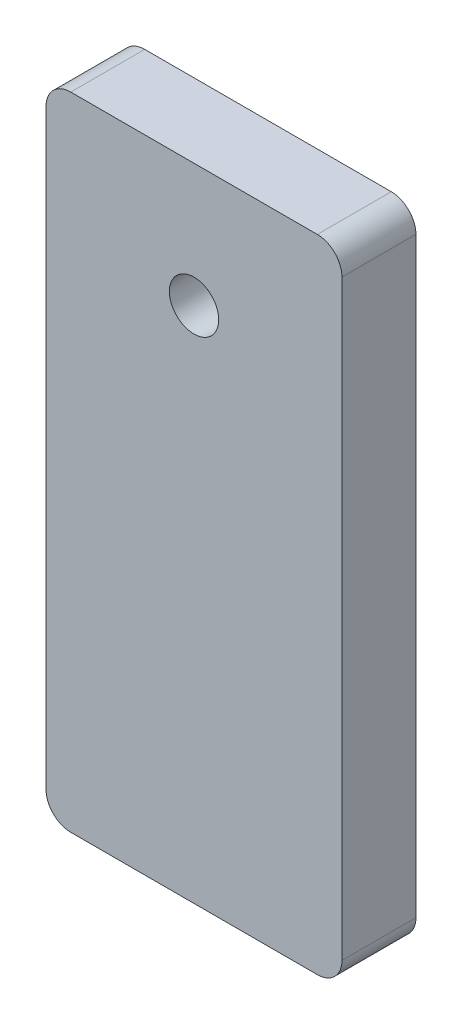
ISO-10303-21;
HEADER;
FILE_DESCRIPTION(('STEP AP214'),'2;1');
FILE_NAME('part.step','',(''),(''),'','','');
FILE_SCHEMA(('AUTOMOTIVE_DESIGN { 1 0 10303 214 1 1 1 1 }'));
ENDSEC;
DATA;
#1=APPLICATION_CONTEXT('core data for automotive mechanical design processes');
#2=APPLICATION_PROTOCOL_DEFINITION('international standard','automotive_design',2000,#1);
#3=PRODUCT_CONTEXT('',#1,'mechanical');
#4=PRODUCT('Part','Part','',(#3));
#5=PRODUCT_RELATED_PRODUCT_CATEGORY('part','',(#4));
#6=PRODUCT_DEFINITION_FORMATION('','',#4);
#7=PRODUCT_DEFINITION_CONTEXT('part definition',#1,'design');
#8=PRODUCT_DEFINITION('design','',#6,#7);
#9=PRODUCT_DEFINITION_SHAPE('','',#8);
#10=(LENGTH_UNIT() NAMED_UNIT(*) SI_UNIT(.MILLI.,.METRE.));
#11=(NAMED_UNIT(*) PLANE_ANGLE_UNIT() SI_UNIT($,.RADIAN.));
#12=(NAMED_UNIT(*) SI_UNIT($,.STERADIAN.) SOLID_ANGLE_UNIT());
#13=UNCERTAINTY_MEASURE_WITH_UNIT(LENGTH_MEASURE(1.E-05),#10,'distance_accuracy_value','');
#14=(GEOMETRIC_REPRESENTATION_CONTEXT(3) GLOBAL_UNCERTAINTY_ASSIGNED_CONTEXT((#13)) GLOBAL_UNIT_ASSIGNED_CONTEXT((#10,
#11,#12)) REPRESENTATION_CONTEXT('',''));
#15=CARTESIAN_POINT('',(0.,0.,0.));
#16=DIRECTION('',(0.,0.,1.));
#17=DIRECTION('',(1.,0.,0.));
#18=AXIS2_PLACEMENT_3D('',#15,#16,#17);
#19=CARTESIAN_POINT('',(4.99999999999999,-1.,3.));
#20=DIRECTION('',(0.,0.,-1.));
#21=DIRECTION('',(-1.,0.,0.));
#22=AXIS2_PLACEMENT_3D('',#19,#20,#21);
#23=PLANE('',#22);
#24=CARTESIAN_POINT('',(4.99999999999999,-1.,3.));
#25=DIRECTION('',(0.,0.,1.));
#26=DIRECTION('',(-1.,0.,0.));
#27=AXIS2_PLACEMENT_3D('',#24,#25,#26);
#28=CIRCLE('',#27,1.);
#29=CARTESIAN_POINT('',(6.,-1.,3.));
#30=VERTEX_POINT('',#29);
#31=CARTESIAN_POINT('',(5.,0.,3.));
#32=VERTEX_POINT('',#31);
#33=EDGE_CURVE('E148',#30,#32,#28,.T.);
#34=ORIENTED_EDGE('',*,*,#33,.T.);
#35=DIRECTION('',(-1.,0.,0.));
#36=VECTOR('',#35,1.);
#37=CARTESIAN_POINT('',(-5.,0.,3.));
#38=LINE('',#37,#36);
#39=CARTESIAN_POINT('',(-5.,0.,3.));
#40=VERTEX_POINT('',#39);
#41=EDGE_CURVE('E96',#32,#40,#38,.T.);
#42=ORIENTED_EDGE('',*,*,#41,.T.);
#43=CARTESIAN_POINT('',(-4.99999999999999,-1.,3.));
#44=DIRECTION('',(0.,0.,1.));
#45=DIRECTION('',(1.,0.,0.));
#46=AXIS2_PLACEMENT_3D('',#43,#44,#45);
#47=CIRCLE('',#46,1.);
#48=CARTESIAN_POINT('',(-6.,-1.,3.));
#49=VERTEX_POINT('',#48);
#50=EDGE_CURVE('E163',#40,#49,#47,.T.);
#51=ORIENTED_EDGE('',*,*,#50,.T.);
#52=DIRECTION('',(0.,-1.,0.));
#53=VECTOR('',#52,1.);
#54=CARTESIAN_POINT('',(-6.,-1.,3.));
#55=LINE('',#54,#53);
#56=CARTESIAN_POINT('',(-6.,-25.,3.));
#57=VERTEX_POINT('',#56);
#58=EDGE_CURVE('E176',#49,#57,#55,.T.);
#59=ORIENTED_EDGE('',*,*,#58,.T.);
#60=CARTESIAN_POINT('',(-5.,-25.,3.));
#61=DIRECTION('',(0.,0.,1.));
#62=DIRECTION('',(1.,0.,0.));
#63=AXIS2_PLACEMENT_3D('',#60,#61,#62);
#64=CIRCLE('',#63,1.);
#65=CARTESIAN_POINT('',(-4.99999999999999,-26.,3.));
#66=VERTEX_POINT('',#65);
#67=EDGE_CURVE('E115',#57,#66,#64,.T.);
#68=ORIENTED_EDGE('',*,*,#67,.T.);
#69=DIRECTION('',(1.,0.,0.));
#70=VECTOR('',#69,1.);
#71=CARTESIAN_POINT('',(-4.99999999999999,-26.,3.));
#72=LINE('',#71,#70);
#73=CARTESIAN_POINT('',(4.99999999999999,-26.,3.));
#74=VERTEX_POINT('',#73);
#75=EDGE_CURVE('E109',#66,#74,#72,.T.);
#76=ORIENTED_EDGE('',*,*,#75,.T.);
#77=CARTESIAN_POINT('',(5.,-25.,3.));
#78=DIRECTION('',(0.,0.,1.));
#79=DIRECTION('',(1.,0.,0.));
#80=AXIS2_PLACEMENT_3D('',#77,#78,#79);
#81=CIRCLE('',#80,1.);
#82=CARTESIAN_POINT('',(6.,-25.,3.));
#83=VERTEX_POINT('',#82);
#84=EDGE_CURVE('E113',#74,#83,#81,.T.);
#85=ORIENTED_EDGE('',*,*,#84,.T.);
#86=DIRECTION('',(0.,1.,0.));
#87=VECTOR('',#86,1.);
#88=CARTESIAN_POINT('',(6.,-1.,3.));
#89=LINE('',#88,#87);
#90=EDGE_CURVE('E53',#83,#30,#89,.T.);
#91=ORIENTED_EDGE('',*,*,#90,.T.);
#92=EDGE_LOOP('',(#34,#42,#51,#59,#68,#76,#85,#91));
#93=FACE_BOUND('',#92,.T.);
#94=CARTESIAN_POINT('',(0.,-5.,3.));
#95=DIRECTION('',(0.,0.,1.));
#96=DIRECTION('',(1.,0.,0.));
#97=AXIS2_PLACEMENT_3D('',#94,#95,#96);
#98=CIRCLE('',#97,1.);
#99=CARTESIAN_POINT('',(1.,-5.,3.));
#100=VERTEX_POINT('',#99);
#101=EDGE_CURVE('E137',#100,#100,#98,.T.);
#102=ORIENTED_EDGE('',*,*,#101,.F.);
#103=EDGE_LOOP('',(#102));
#104=FACE_BOUND('',#103,.T.);
#105=ADVANCED_FACE('F36',(#93,#104),#23,.F.);
#106=CARTESIAN_POINT('',(4.99999999999999,-1.,0.));
#107=DIRECTION('',(0.,0.,-1.));
#108=DIRECTION('',(-1.,0.,0.));
#109=AXIS2_PLACEMENT_3D('',#106,#107,#108);
#110=PLANE('',#109);
#111=CARTESIAN_POINT('',(4.99999999999999,-1.,0.));
#112=DIRECTION('',(0.,0.,1.));
#113=DIRECTION('',(-1.,0.,0.));
#114=AXIS2_PLACEMENT_3D('',#111,#112,#113);
#115=CIRCLE('',#114,1.);
#116=CARTESIAN_POINT('',(6.,-1.,0.));
#117=VERTEX_POINT('',#116);
#118=CARTESIAN_POINT('',(5.,0.,0.));
#119=VERTEX_POINT('',#118);
#120=EDGE_CURVE('E133',#117,#119,#115,.T.);
#121=ORIENTED_EDGE('',*,*,#120,.F.);
#122=DIRECTION('',(0.,1.,0.));
#123=VECTOR('',#122,1.);
#124=CARTESIAN_POINT('',(6.,-1.,0.));
#125=LINE('',#124,#123);
#126=CARTESIAN_POINT('',(6.,-25.,0.));
#127=VERTEX_POINT('',#126);
#128=EDGE_CURVE('E88',#127,#117,#125,.T.);
#129=ORIENTED_EDGE('',*,*,#128,.F.);
#130=CARTESIAN_POINT('',(5.,-25.,0.));
#131=DIRECTION('',(0.,0.,1.));
#132=DIRECTION('',(1.,0.,0.));
#133=AXIS2_PLACEMENT_3D('',#130,#131,#132);
#134=CIRCLE('',#133,1.);
#135=CARTESIAN_POINT('',(4.99999999999999,-26.,0.));
#136=VERTEX_POINT('',#135);
#137=EDGE_CURVE('E82',#136,#127,#134,.T.);
#138=ORIENTED_EDGE('',*,*,#137,.F.);
#139=DIRECTION('',(1.,0.,0.));
#140=VECTOR('',#139,1.);
#141=CARTESIAN_POINT('',(-4.99999999999999,-26.,0.));
#142=LINE('',#141,#140);
#143=CARTESIAN_POINT('',(-4.99999999999999,-26.,0.));
#144=VERTEX_POINT('',#143);
#145=EDGE_CURVE('E123',#144,#136,#142,.T.);
#146=ORIENTED_EDGE('',*,*,#145,.F.);
#147=CARTESIAN_POINT('',(-5.,-25.,0.));
#148=DIRECTION('',(0.,0.,1.));
#149=DIRECTION('',(1.,0.,0.));
#150=AXIS2_PLACEMENT_3D('',#147,#148,#149);
#151=CIRCLE('',#150,1.);
#152=CARTESIAN_POINT('',(-6.,-25.,0.));
#153=VERTEX_POINT('',#152);
#154=EDGE_CURVE('E143',#153,#144,#151,.T.);
#155=ORIENTED_EDGE('',*,*,#154,.F.);
#156=DIRECTION('',(0.,-1.,0.));
#157=VECTOR('',#156,1.);
#158=CARTESIAN_POINT('',(-6.,-1.,0.));
#159=LINE('',#158,#157);
#160=CARTESIAN_POINT('',(-6.,-1.,0.));
#161=VERTEX_POINT('',#160);
#162=EDGE_CURVE('E141',#161,#153,#159,.T.);
#163=ORIENTED_EDGE('',*,*,#162,.F.);
#164=CARTESIAN_POINT('',(-4.99999999999999,-1.,0.));
#165=DIRECTION('',(0.,0.,1.));
#166=DIRECTION('',(1.,0.,0.));
#167=AXIS2_PLACEMENT_3D('',#164,#165,#166);
#168=CIRCLE('',#167,1.);
#169=CARTESIAN_POINT('',(-5.,0.,0.));
#170=VERTEX_POINT('',#169);
#171=EDGE_CURVE('E139',#170,#161,#168,.T.);
#172=ORIENTED_EDGE('',*,*,#171,.F.);
#173=DIRECTION('',(-1.,0.,0.));
#174=VECTOR('',#173,1.);
#175=CARTESIAN_POINT('',(-5.,0.,0.));
#176=LINE('',#175,#174);
#177=EDGE_CURVE('E136',#119,#170,#176,.T.);
#178=ORIENTED_EDGE('',*,*,#177,.F.);
#179=EDGE_LOOP('',(#121,#129,#138,#146,#155,#163,#172,#178));
#180=FACE_BOUND('',#179,.T.);
#181=CARTESIAN_POINT('',(0.,-5.,0.));
#182=DIRECTION('',(0.,0.,1.));
#183=DIRECTION('',(1.,0.,0.));
#184=AXIS2_PLACEMENT_3D('',#181,#182,#183);
#185=CIRCLE('',#184,1.);
#186=CARTESIAN_POINT('',(1.,-5.,0.));
#187=VERTEX_POINT('',#186);
#188=EDGE_CURVE('E182',#187,#187,#185,.T.);
#189=ORIENTED_EDGE('',*,*,#188,.T.);
#190=EDGE_LOOP('',(#189));
#191=FACE_BOUND('',#190,.T.);
#192=ADVANCED_FACE('F167',(#180,#191),#110,.T.);
#193=CARTESIAN_POINT('',(4.99999999999999,-1.,3.));
#194=DIRECTION('',(0.,0.,-1.));
#195=DIRECTION('',(-1.,0.,0.));
#196=AXIS2_PLACEMENT_3D('',#193,#194,#195);
#197=CYLINDRICAL_SURFACE('',#196,1.);
#198=ORIENTED_EDGE('',*,*,#120,.T.);
#199=DIRECTION('',(0.,0.,-1.));
#200=VECTOR('',#199,1.);
#201=CARTESIAN_POINT('',(5.,0.,3.));
#202=LINE('',#201,#200);
#203=EDGE_CURVE('E11',#32,#119,#202,.T.);
#204=ORIENTED_EDGE('',*,*,#203,.F.);
#205=ORIENTED_EDGE('',*,*,#33,.F.);
#206=DIRECTION('',(0.,0.,-1.));
#207=VECTOR('',#206,1.);
#208=CARTESIAN_POINT('',(6.,-1.,3.));
#209=LINE('',#208,#207);
#210=EDGE_CURVE('E129',#30,#117,#209,.T.);
#211=ORIENTED_EDGE('',*,*,#210,.T.);
#212=EDGE_LOOP('',(#198,#204,#205,#211));
#213=FACE_BOUND('',#212,.T.);
#214=ADVANCED_FACE('F38',(#213),#197,.T.);
#215=CARTESIAN_POINT('',(-5.,0.,3.));
#216=DIRECTION('',(0.,-1.,0.));
#217=DIRECTION('',(0.,0.,-1.));
#218=AXIS2_PLACEMENT_3D('',#215,#216,#217);
#219=PLANE('',#218);
#220=ORIENTED_EDGE('',*,*,#177,.T.);
#221=DIRECTION('',(0.,0.,-1.));
#222=VECTOR('',#221,1.);
#223=CARTESIAN_POINT('',(-5.,0.,3.));
#224=LINE('',#223,#222);
#225=EDGE_CURVE('E45',#40,#170,#224,.T.);
#226=ORIENTED_EDGE('',*,*,#225,.F.);
#227=ORIENTED_EDGE('',*,*,#41,.F.);
#228=ORIENTED_EDGE('',*,*,#203,.T.);
#229=EDGE_LOOP('',(#220,#226,#227,#228));
#230=FACE_BOUND('',#229,.T.);
#231=ADVANCED_FACE('F210',(#230),#219,.F.);
#232=CARTESIAN_POINT('',(-4.99999999999999,-1.,3.));
#233=DIRECTION('',(0.,0.,-1.));
#234=DIRECTION('',(-1.,0.,0.));
#235=AXIS2_PLACEMENT_3D('',#232,#233,#234);
#236=CYLINDRICAL_SURFACE('',#235,1.);
#237=ORIENTED_EDGE('',*,*,#171,.T.);
#238=DIRECTION('',(0.,0.,-1.));
#239=VECTOR('',#238,1.);
#240=CARTESIAN_POINT('',(-6.,-1.,3.));
#241=LINE('',#240,#239);
#242=EDGE_CURVE('E155',#49,#161,#241,.T.);
#243=ORIENTED_EDGE('',*,*,#242,.F.);
#244=ORIENTED_EDGE('',*,*,#50,.F.);
#245=ORIENTED_EDGE('',*,*,#225,.T.);
#246=EDGE_LOOP('',(#237,#243,#244,#245));
#247=FACE_BOUND('',#246,.T.);
#248=ADVANCED_FACE('F161',(#247),#236,.T.);
#249=CARTESIAN_POINT('',(-6.,-1.,3.));
#250=DIRECTION('',(1.,0.,0.));
#251=DIRECTION('',(0.,1.,0.));
#252=AXIS2_PLACEMENT_3D('',#249,#250,#251);
#253=PLANE('',#252);
#254=ORIENTED_EDGE('',*,*,#162,.T.);
#255=DIRECTION('',(0.,0.,-1.));
#256=VECTOR('',#255,1.);
#257=CARTESIAN_POINT('',(-6.,-25.,3.));
#258=LINE('',#257,#256);
#259=EDGE_CURVE('E152',#57,#153,#258,.T.);
#260=ORIENTED_EDGE('',*,*,#259,.F.);
#261=ORIENTED_EDGE('',*,*,#58,.F.);
#262=ORIENTED_EDGE('',*,*,#242,.T.);
#263=EDGE_LOOP('',(#254,#260,#261,#262));
#264=FACE_BOUND('',#263,.T.);
#265=ADVANCED_FACE('F172',(#264),#253,.F.);
#266=CARTESIAN_POINT('',(-5.,-25.,3.));
#267=DIRECTION('',(0.,0.,-1.));
#268=DIRECTION('',(-1.,0.,0.));
#269=AXIS2_PLACEMENT_3D('',#266,#267,#268);
#270=CYLINDRICAL_SURFACE('',#269,1.);
#271=ORIENTED_EDGE('',*,*,#154,.T.);
#272=DIRECTION('',(0.,0.,-1.));
#273=VECTOR('',#272,1.);
#274=CARTESIAN_POINT('',(-4.99999999999999,-26.,3.));
#275=LINE('',#274,#273);
#276=EDGE_CURVE('E124',#66,#144,#275,.T.);
#277=ORIENTED_EDGE('',*,*,#276,.F.);
#278=ORIENTED_EDGE('',*,*,#67,.F.);
#279=ORIENTED_EDGE('',*,*,#259,.T.);
#280=EDGE_LOOP('',(#271,#277,#278,#279));
#281=FACE_BOUND('',#280,.T.);
#282=ADVANCED_FACE('F175',(#281),#270,.T.);
#283=CARTESIAN_POINT('',(-4.99999999999999,-26.,3.));
#284=DIRECTION('',(0.,1.,0.));
#285=DIRECTION('',(-1.,0.,0.));
#286=AXIS2_PLACEMENT_3D('',#283,#284,#285);
#287=PLANE('',#286);
#288=ORIENTED_EDGE('',*,*,#145,.T.);
#289=DIRECTION('',(0.,0.,-1.));
#290=VECTOR('',#289,1.);
#291=CARTESIAN_POINT('',(4.99999999999999,-26.,3.));
#292=LINE('',#291,#290);
#293=EDGE_CURVE('E120',#74,#136,#292,.T.);
#294=ORIENTED_EDGE('',*,*,#293,.F.);
#295=ORIENTED_EDGE('',*,*,#75,.F.);
#296=ORIENTED_EDGE('',*,*,#276,.T.);
#297=EDGE_LOOP('',(#288,#294,#295,#296));
#298=FACE_BOUND('',#297,.T.);
#299=ADVANCED_FACE('F121',(#298),#287,.F.);
#300=CARTESIAN_POINT('',(5.,-25.,3.));
#301=DIRECTION('',(0.,0.,-1.));
#302=DIRECTION('',(-1.,0.,0.));
#303=AXIS2_PLACEMENT_3D('',#300,#301,#302);
#304=CYLINDRICAL_SURFACE('',#303,1.);
#305=ORIENTED_EDGE('',*,*,#137,.T.);
#306=DIRECTION('',(0.,0.,-1.));
#307=VECTOR('',#306,1.);
#308=CARTESIAN_POINT('',(6.,-25.,3.));
#309=LINE('',#308,#307);
#310=EDGE_CURVE('E125',#83,#127,#309,.T.);
#311=ORIENTED_EDGE('',*,*,#310,.F.);
#312=ORIENTED_EDGE('',*,*,#84,.F.);
#313=ORIENTED_EDGE('',*,*,#293,.T.);
#314=EDGE_LOOP('',(#305,#311,#312,#313));
#315=FACE_BOUND('',#314,.T.);
#316=ADVANCED_FACE('F127',(#315),#304,.T.);
#317=CARTESIAN_POINT('',(6.,-1.,3.));
#318=DIRECTION('',(-1.,0.,0.));
#319=DIRECTION('',(0.,-1.,0.));
#320=AXIS2_PLACEMENT_3D('',#317,#318,#319);
#321=PLANE('',#320);
#322=ORIENTED_EDGE('',*,*,#128,.T.);
#323=ORIENTED_EDGE('',*,*,#210,.F.);
#324=ORIENTED_EDGE('',*,*,#90,.F.);
#325=ORIENTED_EDGE('',*,*,#310,.T.);
#326=EDGE_LOOP('',(#322,#323,#324,#325));
#327=FACE_BOUND('',#326,.T.);
#328=ADVANCED_FACE('F198',(#327),#321,.F.);
#329=CARTESIAN_POINT('',(0.,-5.,3.));
#330=DIRECTION('',(0.,0.,-1.));
#331=DIRECTION('',(-1.,0.,0.));
#332=AXIS2_PLACEMENT_3D('',#329,#330,#331);
#333=CYLINDRICAL_SURFACE('',#332,1.);
#334=ORIENTED_EDGE('',*,*,#101,.T.);
#335=EDGE_LOOP('',(#334));
#336=FACE_BOUND('',#335,.T.);
#337=ORIENTED_EDGE('',*,*,#188,.F.);
#338=EDGE_LOOP('',(#337));
#339=FACE_BOUND('',#338,.T.);
#340=ADVANCED_FACE('F188',(#336,#339),#333,.F.);
#341=CLOSED_SHELL('',(#105,#192,#214,#231,#248,#265,#282,#299,#316,#328,#340));
#342=MANIFOLD_SOLID_BREP('B2',#341);
#343=ADVANCED_BREP_SHAPE_REPRESENTATION('',(#18,#342),#14);
#344=SHAPE_DEFINITION_REPRESENTATION(#9,#343);
ENDSEC;
END-ISO-10303-21;
